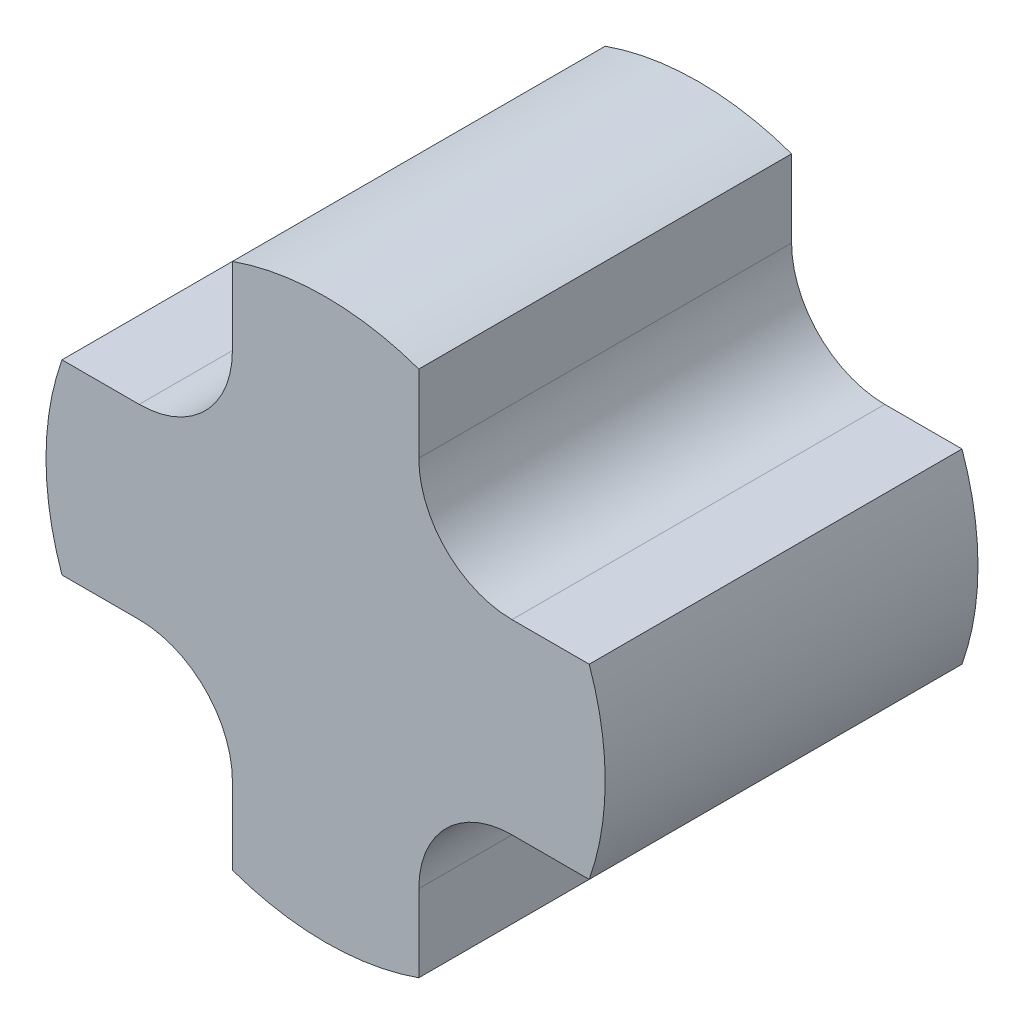
ISO-10303-21;
HEADER;
FILE_DESCRIPTION(('STEP AP214'),'2;1');
FILE_NAME('part.step','',(''),(''),'','','');
FILE_SCHEMA(('AUTOMOTIVE_DESIGN { 1 0 10303 214 1 1 1 1 }'));
ENDSEC;
DATA;
#1=APPLICATION_CONTEXT('core data for automotive mechanical design processes');
#2=APPLICATION_PROTOCOL_DEFINITION('international standard','automotive_design',2000,#1);
#3=PRODUCT_CONTEXT('',#1,'mechanical');
#4=PRODUCT('Part','Part','',(#3));
#5=PRODUCT_RELATED_PRODUCT_CATEGORY('part','',(#4));
#6=PRODUCT_DEFINITION_FORMATION('','',#4);
#7=PRODUCT_DEFINITION_CONTEXT('part definition',#1,'design');
#8=PRODUCT_DEFINITION('design','',#6,#7);
#9=PRODUCT_DEFINITION_SHAPE('','',#8);
#10=(LENGTH_UNIT() NAMED_UNIT(*) SI_UNIT(.MILLI.,.METRE.));
#11=(NAMED_UNIT(*) PLANE_ANGLE_UNIT() SI_UNIT($,.RADIAN.));
#12=(NAMED_UNIT(*) SI_UNIT($,.STERADIAN.) SOLID_ANGLE_UNIT());
#13=UNCERTAINTY_MEASURE_WITH_UNIT(LENGTH_MEASURE(1.E-05),#10,'distance_accuracy_value','');
#14=(GEOMETRIC_REPRESENTATION_CONTEXT(3) GLOBAL_UNCERTAINTY_ASSIGNED_CONTEXT((#13)) GLOBAL_UNIT_ASSIGNED_CONTEXT((#10,
#11,#12)) REPRESENTATION_CONTEXT('',''));
#15=CARTESIAN_POINT('',(0.,0.,0.));
#16=DIRECTION('',(0.,0.,1.));
#17=DIRECTION('',(1.,0.,0.));
#18=AXIS2_PLACEMENT_3D('',#15,#16,#17);
#19=CARTESIAN_POINT('',(-141.42135623731,-50.,200.));
#20=DIRECTION('',(0.,1.,0.));
#21=DIRECTION('',(0.,0.,1.));
#22=AXIS2_PLACEMENT_3D('',#19,#20,#21);
#23=PLANE('',#22);
#24=DIRECTION('',(1.,0.,0.));
#25=VECTOR('',#24,1.);
#26=CARTESIAN_POINT('',(-141.42135623731,-50.,0.));
#27=LINE('',#26,#25);
#28=CARTESIAN_POINT('',(-141.42135623731,-50.,0.));
#29=VERTEX_POINT('',#28);
#30=CARTESIAN_POINT('',(-99.9999999999996,-50.,0.));
#31=VERTEX_POINT('',#30);
#32=EDGE_CURVE('E238',#29,#31,#27,.T.);
#33=ORIENTED_EDGE('',*,*,#32,.T.);
#34=DIRECTION('',(0.,0.,-1.));
#35=VECTOR('',#34,1.);
#36=CARTESIAN_POINT('',(-99.9999999999996,-50.,200.));
#37=LINE('',#36,#35);
#38=CARTESIAN_POINT('',(-99.9999999999996,-50.,200.));
#39=VERTEX_POINT('',#38);
#40=EDGE_CURVE('E62',#31,#39,#37,.F.);
#41=ORIENTED_EDGE('',*,*,#40,.T.);
#42=DIRECTION('',(1.,0.,0.));
#43=VECTOR('',#42,1.);
#44=CARTESIAN_POINT('',(-141.42135623731,-50.,200.));
#45=LINE('',#44,#43);
#46=CARTESIAN_POINT('',(-141.42135623731,-50.,200.));
#47=VERTEX_POINT('',#46);
#48=EDGE_CURVE('E230',#47,#39,#45,.T.);
#49=ORIENTED_EDGE('',*,*,#48,.F.);
#50=DIRECTION('',(0.,0.,-1.));
#51=VECTOR('',#50,1.);
#52=CARTESIAN_POINT('',(-141.42135623731,-50.,200.));
#53=LINE('',#52,#51);
#54=EDGE_CURVE('E243',#47,#29,#53,.T.);
#55=ORIENTED_EDGE('',*,*,#54,.T.);
#56=EDGE_LOOP('',(#33,#41,#49,#55));
#57=FACE_BOUND('',#56,.T.);
#58=ADVANCED_FACE('F41',(#57),#23,.F.);
#59=CARTESIAN_POINT('',(-141.421356237309,50.,200.));
#60=DIRECTION('',(0.,-1.,0.));
#61=DIRECTION('',(0.,0.,-1.));
#62=AXIS2_PLACEMENT_3D('',#59,#60,#61);
#63=PLANE('',#62);
#64=DIRECTION('',(-1.,0.,0.));
#65=VECTOR('',#64,1.);
#66=CARTESIAN_POINT('',(-141.421356237309,50.,200.));
#67=LINE('',#66,#65);
#68=CARTESIAN_POINT('',(-100.,50.,200.));
#69=VERTEX_POINT('',#68);
#70=CARTESIAN_POINT('',(-141.421356237309,50.,200.));
#71=VERTEX_POINT('',#70);
#72=EDGE_CURVE('E233',#69,#71,#67,.T.);
#73=ORIENTED_EDGE('',*,*,#72,.F.);
#74=DIRECTION('',(0.,0.,1.));
#75=VECTOR('',#74,1.);
#76=CARTESIAN_POINT('',(-100.,50.,0.));
#77=LINE('',#76,#75);
#78=CARTESIAN_POINT('',(-100.,50.,0.));
#79=VERTEX_POINT('',#78);
#80=EDGE_CURVE('E257',#69,#79,#77,.F.);
#81=ORIENTED_EDGE('',*,*,#80,.T.);
#82=DIRECTION('',(-1.,0.,0.));
#83=VECTOR('',#82,1.);
#84=CARTESIAN_POINT('',(-141.421356237309,50.,0.));
#85=LINE('',#84,#83);
#86=CARTESIAN_POINT('',(-141.421356237309,50.,0.));
#87=VERTEX_POINT('',#86);
#88=EDGE_CURVE('E231',#79,#87,#85,.T.);
#89=ORIENTED_EDGE('',*,*,#88,.T.);
#90=DIRECTION('',(0.,0.,-1.));
#91=VECTOR('',#90,1.);
#92=CARTESIAN_POINT('',(-141.421356237309,50.,200.));
#93=LINE('',#92,#91);
#94=EDGE_CURVE('E235',#71,#87,#93,.T.);
#95=ORIENTED_EDGE('',*,*,#94,.F.);
#96=EDGE_LOOP('',(#73,#81,#89,#95));
#97=FACE_BOUND('',#96,.T.);
#98=ADVANCED_FACE('F284',(#97),#63,.F.);
#99=CARTESIAN_POINT('',(0.,0.,200.));
#100=DIRECTION('',(0.,0.,-1.));
#101=DIRECTION('',(-1.,0.,0.));
#102=AXIS2_PLACEMENT_3D('',#99,#100,#101);
#103=CYLINDRICAL_SURFACE('',#102,150.);
#104=CARTESIAN_POINT('',(0.,0.,0.));
#105=DIRECTION('',(0.,0.,1.));
#106=DIRECTION('',(1.,0.,0.));
#107=AXIS2_PLACEMENT_3D('',#104,#105,#106);
#108=CIRCLE('',#107,150.);
#109=EDGE_CURVE('E226',#87,#29,#108,.T.);
#110=ORIENTED_EDGE('',*,*,#109,.T.);
#111=ORIENTED_EDGE('',*,*,#54,.F.);
#112=CARTESIAN_POINT('',(0.,0.,200.));
#113=DIRECTION('',(0.,0.,1.));
#114=DIRECTION('',(1.,0.,0.));
#115=AXIS2_PLACEMENT_3D('',#112,#113,#114);
#116=CIRCLE('',#115,150.);
#117=EDGE_CURVE('E227',#71,#47,#116,.T.);
#118=ORIENTED_EDGE('',*,*,#117,.F.);
#119=ORIENTED_EDGE('',*,*,#94,.T.);
#120=EDGE_LOOP('',(#110,#111,#118,#119));
#121=FACE_BOUND('',#120,.T.);
#122=ADVANCED_FACE('F288',(#121),#103,.T.);
#123=CARTESIAN_POINT('',(0.,0.,200.));
#124=DIRECTION('',(0.,0.,1.));
#125=DIRECTION('',(1.,0.,0.));
#126=AXIS2_PLACEMENT_3D('',#123,#124,#125);
#127=PLANE('',#126);
#128=DIRECTION('',(0.,-1.,0.));
#129=VECTOR('',#128,1.);
#130=CARTESIAN_POINT('',(-49.9999999999995,-141.42135623731,200.));
#131=LINE('',#130,#129);
#132=CARTESIAN_POINT('',(-50.0000000000015,141.421356237309,200.));
#133=VERTEX_POINT('',#132);
#134=CARTESIAN_POINT('',(-50.0000000000003,100.,200.));
#135=VERTEX_POINT('',#134);
#136=EDGE_CURVE('E153',#133,#135,#131,.T.);
#137=ORIENTED_EDGE('',*,*,#136,.T.);
#138=CARTESIAN_POINT('',(-100.,100.,200.));
#139=DIRECTION('',(0.,0.,1.));
#140=DIRECTION('',(1.,0.,0.));
#141=AXIS2_PLACEMENT_3D('',#138,#139,#140);
#142=CIRCLE('',#141,50.);
#143=EDGE_CURVE('E271',#135,#69,#142,.F.);
#144=ORIENTED_EDGE('',*,*,#143,.T.);
#145=ORIENTED_EDGE('',*,*,#72,.T.);
#146=ORIENTED_EDGE('',*,*,#117,.T.);
#147=ORIENTED_EDGE('',*,*,#48,.T.);
#148=CARTESIAN_POINT('',(-99.9999999999996,-100.,200.));
#149=DIRECTION('',(0.,0.,1.));
#150=DIRECTION('',(1.,0.,0.));
#151=AXIS2_PLACEMENT_3D('',#148,#149,#150);
#152=CIRCLE('',#151,50.);
#153=CARTESIAN_POINT('',(-49.9999999999997,-99.9999999999998,200.));
#154=VERTEX_POINT('',#153);
#155=EDGE_CURVE('E11',#39,#154,#152,.F.);
#156=ORIENTED_EDGE('',*,*,#155,.T.);
#157=CARTESIAN_POINT('',(-49.9999999999995,-141.42135623731,200.));
#158=VERTEX_POINT('',#157);
#159=EDGE_CURVE('E164',#154,#158,#131,.T.);
#160=ORIENTED_EDGE('',*,*,#159,.T.);
#161=CARTESIAN_POINT('',(0.,0.,200.));
#162=DIRECTION('',(0.,0.,1.));
#163=DIRECTION('',(0.,1.,0.));
#164=AXIS2_PLACEMENT_3D('',#161,#162,#163);
#165=CIRCLE('',#164,150.);
#166=CARTESIAN_POINT('',(50.0000000000005,-141.421356237309,200.));
#167=VERTEX_POINT('',#166);
#168=EDGE_CURVE('E207',#158,#167,#165,.T.);
#169=ORIENTED_EDGE('',*,*,#168,.T.);
#170=DIRECTION('',(0.,1.,0.));
#171=VECTOR('',#170,1.);
#172=CARTESIAN_POINT('',(50.0000000000005,-141.421356237309,200.));
#173=LINE('',#172,#171);
#174=CARTESIAN_POINT('',(50.0000000000003,-100.,200.));
#175=VERTEX_POINT('',#174);
#176=EDGE_CURVE('E210',#167,#175,#173,.T.);
#177=ORIENTED_EDGE('',*,*,#176,.T.);
#178=CARTESIAN_POINT('',(100.,-100.,200.));
#179=DIRECTION('',(0.,0.,1.));
#180=DIRECTION('',(1.,0.,0.));
#181=AXIS2_PLACEMENT_3D('',#178,#179,#180);
#182=CIRCLE('',#181,50.);
#183=CARTESIAN_POINT('',(100.,-50.,200.));
#184=VERTEX_POINT('',#183);
#185=EDGE_CURVE('E269',#175,#184,#182,.F.);
#186=ORIENTED_EDGE('',*,*,#185,.T.);
#187=DIRECTION('',(1.,0.,0.));
#188=VECTOR('',#187,1.);
#189=CARTESIAN_POINT('',(141.421356237309,-50.,200.));
#190=LINE('',#189,#188);
#191=CARTESIAN_POINT('',(141.421356237309,-50.,200.));
#192=VERTEX_POINT('',#191);
#193=EDGE_CURVE('E195',#184,#192,#190,.T.);
#194=ORIENTED_EDGE('',*,*,#193,.T.);
#195=CARTESIAN_POINT('',(0.,0.,200.));
#196=DIRECTION('',(0.,0.,1.));
#197=DIRECTION('',(-1.,0.,0.));
#198=AXIS2_PLACEMENT_3D('',#195,#196,#197);
#199=CIRCLE('',#198,150.);
#200=CARTESIAN_POINT('',(141.42135623731,50.,200.));
#201=VERTEX_POINT('',#200);
#202=EDGE_CURVE('E188',#192,#201,#199,.T.);
#203=ORIENTED_EDGE('',*,*,#202,.T.);
#204=DIRECTION('',(-1.,0.,0.));
#205=VECTOR('',#204,1.);
#206=CARTESIAN_POINT('',(141.42135623731,50.,200.));
#207=LINE('',#206,#205);
#208=CARTESIAN_POINT('',(99.9999999999989,50.,200.));
#209=VERTEX_POINT('',#208);
#210=EDGE_CURVE('E191',#201,#209,#207,.T.);
#211=ORIENTED_EDGE('',*,*,#210,.T.);
#212=CARTESIAN_POINT('',(99.9999999999989,100.,200.));
#213=DIRECTION('',(0.,0.,1.));
#214=DIRECTION('',(1.,0.,0.));
#215=AXIS2_PLACEMENT_3D('',#212,#213,#214);
#216=CIRCLE('',#215,50.);
#217=CARTESIAN_POINT('',(49.999999999999,99.9999999999995,200.));
#218=VERTEX_POINT('',#217);
#219=EDGE_CURVE('E265',#209,#218,#216,.F.);
#220=ORIENTED_EDGE('',*,*,#219,.T.);
#221=DIRECTION('',(0.,1.,0.));
#222=VECTOR('',#221,1.);
#223=CARTESIAN_POINT('',(49.9999999999985,141.42135623731,200.));
#224=LINE('',#223,#222);
#225=CARTESIAN_POINT('',(49.9999999999985,141.42135623731,200.));
#226=VERTEX_POINT('',#225);
#227=EDGE_CURVE('E170',#218,#226,#224,.T.);
#228=ORIENTED_EDGE('',*,*,#227,.T.);
#229=CARTESIAN_POINT('',(0.,0.,200.));
#230=DIRECTION('',(0.,0.,1.));
#231=DIRECTION('',(0.,-1.,0.));
#232=AXIS2_PLACEMENT_3D('',#229,#230,#231);
#233=CIRCLE('',#232,150.);
#234=EDGE_CURVE('E167',#226,#133,#233,.T.);
#235=ORIENTED_EDGE('',*,*,#234,.T.);
#236=EDGE_LOOP('',(#137,#144,#145,#146,#147,#156,#160,#169,#177,#186,#194,#203,#211,#220,#228,#235));
#237=FACE_BOUND('',#236,.T.);
#238=ADVANCED_FACE('F168',(#237),#127,.T.);
#239=CARTESIAN_POINT('',(0.,0.,0.));
#240=DIRECTION('',(0.,0.,1.));
#241=DIRECTION('',(1.,0.,0.));
#242=AXIS2_PLACEMENT_3D('',#239,#240,#241);
#243=PLANE('',#242);
#244=ORIENTED_EDGE('',*,*,#88,.F.);
#245=CARTESIAN_POINT('',(-100.,100.,0.));
#246=DIRECTION('',(0.,0.,1.));
#247=DIRECTION('',(1.,0.,0.));
#248=AXIS2_PLACEMENT_3D('',#245,#246,#247);
#249=CIRCLE('',#248,50.);
#250=CARTESIAN_POINT('',(-50.0000000000003,100.,0.));
#251=VERTEX_POINT('',#250);
#252=EDGE_CURVE('E273',#79,#251,#249,.T.);
#253=ORIENTED_EDGE('',*,*,#252,.T.);
#254=DIRECTION('',(0.,-1.,0.));
#255=VECTOR('',#254,1.);
#256=CARTESIAN_POINT('',(-49.9999999999995,-141.42135623731,0.));
#257=LINE('',#256,#255);
#258=CARTESIAN_POINT('',(-50.0000000000015,141.421356237309,0.));
#259=VERTEX_POINT('',#258);
#260=EDGE_CURVE('E211',#259,#251,#257,.T.);
#261=ORIENTED_EDGE('',*,*,#260,.F.);
#262=CARTESIAN_POINT('',(0.,0.,0.));
#263=DIRECTION('',(0.,0.,1.));
#264=DIRECTION('',(0.,-1.,0.));
#265=AXIS2_PLACEMENT_3D('',#262,#263,#264);
#266=CIRCLE('',#265,150.);
#267=CARTESIAN_POINT('',(49.9999999999985,141.42135623731,0.));
#268=VERTEX_POINT('',#267);
#269=EDGE_CURVE('E178',#268,#259,#266,.T.);
#270=ORIENTED_EDGE('',*,*,#269,.F.);
#271=DIRECTION('',(0.,1.,0.));
#272=VECTOR('',#271,1.);
#273=CARTESIAN_POINT('',(49.9999999999985,141.42135623731,0.));
#274=LINE('',#273,#272);
#275=CARTESIAN_POINT('',(49.999999999999,99.9999999999995,0.));
#276=VERTEX_POINT('',#275);
#277=EDGE_CURVE('E174',#276,#268,#274,.T.);
#278=ORIENTED_EDGE('',*,*,#277,.F.);
#279=CARTESIAN_POINT('',(99.9999999999989,100.,0.));
#280=DIRECTION('',(0.,0.,1.));
#281=DIRECTION('',(1.,0.,0.));
#282=AXIS2_PLACEMENT_3D('',#279,#280,#281);
#283=CIRCLE('',#282,50.);
#284=CARTESIAN_POINT('',(99.9999999999989,50.,0.));
#285=VERTEX_POINT('',#284);
#286=EDGE_CURVE('E263',#276,#285,#283,.T.);
#287=ORIENTED_EDGE('',*,*,#286,.T.);
#288=DIRECTION('',(-1.,0.,0.));
#289=VECTOR('',#288,1.);
#290=CARTESIAN_POINT('',(141.42135623731,50.,0.));
#291=LINE('',#290,#289);
#292=CARTESIAN_POINT('',(141.42135623731,50.,0.));
#293=VERTEX_POINT('',#292);
#294=EDGE_CURVE('E183',#293,#285,#291,.T.);
#295=ORIENTED_EDGE('',*,*,#294,.F.);
#296=CARTESIAN_POINT('',(0.,0.,0.));
#297=DIRECTION('',(0.,0.,1.));
#298=DIRECTION('',(-1.,0.,0.));
#299=AXIS2_PLACEMENT_3D('',#296,#297,#298);
#300=CIRCLE('',#299,150.);
#301=CARTESIAN_POINT('',(141.421356237309,-50.,0.));
#302=VERTEX_POINT('',#301);
#303=EDGE_CURVE('E179',#302,#293,#300,.T.);
#304=ORIENTED_EDGE('',*,*,#303,.F.);
#305=DIRECTION('',(1.,0.,0.));
#306=VECTOR('',#305,1.);
#307=CARTESIAN_POINT('',(141.421356237309,-50.,0.));
#308=LINE('',#307,#306);
#309=CARTESIAN_POINT('',(100.,-50.,0.));
#310=VERTEX_POINT('',#309);
#311=EDGE_CURVE('E192',#310,#302,#308,.T.);
#312=ORIENTED_EDGE('',*,*,#311,.F.);
#313=CARTESIAN_POINT('',(100.,-100.,0.));
#314=DIRECTION('',(0.,0.,1.));
#315=DIRECTION('',(1.,0.,0.));
#316=AXIS2_PLACEMENT_3D('',#313,#314,#315);
#317=CIRCLE('',#316,50.);
#318=CARTESIAN_POINT('',(50.0000000000003,-100.,0.));
#319=VERTEX_POINT('',#318);
#320=EDGE_CURVE('E267',#310,#319,#317,.T.);
#321=ORIENTED_EDGE('',*,*,#320,.T.);
#322=DIRECTION('',(0.,1.,0.));
#323=VECTOR('',#322,1.);
#324=CARTESIAN_POINT('',(50.0000000000005,-141.421356237309,0.));
#325=LINE('',#324,#323);
#326=CARTESIAN_POINT('',(50.0000000000005,-141.421356237309,0.));
#327=VERTEX_POINT('',#326);
#328=EDGE_CURVE('E216',#327,#319,#325,.T.);
#329=ORIENTED_EDGE('',*,*,#328,.F.);
#330=CARTESIAN_POINT('',(0.,0.,0.));
#331=DIRECTION('',(0.,0.,1.));
#332=DIRECTION('',(0.,1.,0.));
#333=AXIS2_PLACEMENT_3D('',#330,#331,#332);
#334=CIRCLE('',#333,150.);
#335=CARTESIAN_POINT('',(-49.9999999999995,-141.42135623731,0.));
#336=VERTEX_POINT('',#335);
#337=EDGE_CURVE('E206',#336,#327,#334,.T.);
#338=ORIENTED_EDGE('',*,*,#337,.F.);
#339=CARTESIAN_POINT('',(-49.9999999999997,-99.9999999999998,0.));
#340=VERTEX_POINT('',#339);
#341=EDGE_CURVE('E219',#340,#336,#257,.T.);
#342=ORIENTED_EDGE('',*,*,#341,.F.);
#343=CARTESIAN_POINT('',(-99.9999999999996,-100.,0.));
#344=DIRECTION('',(0.,0.,1.));
#345=DIRECTION('',(1.,0.,0.));
#346=AXIS2_PLACEMENT_3D('',#343,#344,#345);
#347=CIRCLE('',#346,50.);
#348=EDGE_CURVE('E49',#340,#31,#347,.T.);
#349=ORIENTED_EDGE('',*,*,#348,.T.);
#350=ORIENTED_EDGE('',*,*,#32,.F.);
#351=ORIENTED_EDGE('',*,*,#109,.F.);
#352=EDGE_LOOP('',(#244,#253,#261,#270,#278,#287,#295,#304,#312,#321,#329,#338,#342,#349,#350,#351));
#353=FACE_BOUND('',#352,.T.);
#354=ADVANCED_FACE('F276',(#353),#243,.F.);
#355=CARTESIAN_POINT('',(-49.9999999999995,-141.42135623731,200.));
#356=DIRECTION('',(1.,0.,0.));
#357=DIRECTION('',(0.,0.,-1.));
#358=AXIS2_PLACEMENT_3D('',#355,#356,#357);
#359=PLANE('',#358);
#360=ORIENTED_EDGE('',*,*,#159,.F.);
#361=DIRECTION('',(0.,0.,-1.));
#362=VECTOR('',#361,1.);
#363=CARTESIAN_POINT('',(-49.9999999999997,-99.9999999999998,0.));
#364=LINE('',#363,#362);
#365=EDGE_CURVE('E259',#154,#340,#364,.T.);
#366=ORIENTED_EDGE('',*,*,#365,.T.);
#367=ORIENTED_EDGE('',*,*,#341,.T.);
#368=DIRECTION('',(0.,0.,-1.));
#369=VECTOR('',#368,1.);
#370=CARTESIAN_POINT('',(-49.9999999999995,-141.42135623731,200.));
#371=LINE('',#370,#369);
#372=EDGE_CURVE('E163',#158,#336,#371,.T.);
#373=ORIENTED_EDGE('',*,*,#372,.F.);
#374=EDGE_LOOP('',(#360,#366,#367,#373));
#375=FACE_BOUND('',#374,.T.);
#376=ADVANCED_FACE('F294',(#375),#359,.F.);
#377=ORIENTED_EDGE('',*,*,#260,.T.);
#378=DIRECTION('',(0.,0.,1.));
#379=VECTOR('',#378,1.);
#380=CARTESIAN_POINT('',(-50.0000000000003,100.,200.));
#381=LINE('',#380,#379);
#382=EDGE_CURVE('E161',#251,#135,#381,.T.);
#383=ORIENTED_EDGE('',*,*,#382,.T.);
#384=ORIENTED_EDGE('',*,*,#136,.F.);
#385=DIRECTION('',(0.,0.,-1.));
#386=VECTOR('',#385,1.);
#387=CARTESIAN_POINT('',(-50.0000000000015,141.421356237309,200.));
#388=LINE('',#387,#386);
#389=EDGE_CURVE('E158',#133,#259,#388,.T.);
#390=ORIENTED_EDGE('',*,*,#389,.T.);
#391=EDGE_LOOP('',(#377,#383,#384,#390));
#392=FACE_BOUND('',#391,.T.);
#393=ADVANCED_FACE('F156',(#392),#359,.F.);
#394=CARTESIAN_POINT('',(50.0000000000005,-141.421356237309,200.));
#395=DIRECTION('',(-1.,0.,0.));
#396=DIRECTION('',(0.,0.,1.));
#397=AXIS2_PLACEMENT_3D('',#394,#395,#396);
#398=PLANE('',#397);
#399=ORIENTED_EDGE('',*,*,#328,.T.);
#400=DIRECTION('',(0.,0.,-1.));
#401=VECTOR('',#400,1.);
#402=CARTESIAN_POINT('',(50.0000000000003,-100.,200.));
#403=LINE('',#402,#401);
#404=EDGE_CURVE('E254',#319,#175,#403,.F.);
#405=ORIENTED_EDGE('',*,*,#404,.T.);
#406=ORIENTED_EDGE('',*,*,#176,.F.);
#407=DIRECTION('',(0.,0.,-1.));
#408=VECTOR('',#407,1.);
#409=CARTESIAN_POINT('',(50.0000000000005,-141.421356237309,200.));
#410=LINE('',#409,#408);
#411=EDGE_CURVE('E223',#167,#327,#410,.T.);
#412=ORIENTED_EDGE('',*,*,#411,.T.);
#413=EDGE_LOOP('',(#399,#405,#406,#412));
#414=FACE_BOUND('',#413,.T.);
#415=ADVANCED_FACE('F411',(#414),#398,.F.);
#416=CARTESIAN_POINT('',(0.,0.,200.));
#417=DIRECTION('',(0.,0.,-1.));
#418=DIRECTION('',(0.,-1.,0.));
#419=AXIS2_PLACEMENT_3D('',#416,#417,#418);
#420=CYLINDRICAL_SURFACE('',#419,150.);
#421=ORIENTED_EDGE('',*,*,#337,.T.);
#422=ORIENTED_EDGE('',*,*,#411,.F.);
#423=ORIENTED_EDGE('',*,*,#168,.F.);
#424=ORIENTED_EDGE('',*,*,#372,.T.);
#425=EDGE_LOOP('',(#421,#422,#423,#424));
#426=FACE_BOUND('',#425,.T.);
#427=ADVANCED_FACE('F299',(#426),#420,.T.);
#428=CARTESIAN_POINT('',(141.421356237309,-50.,200.));
#429=DIRECTION('',(0.,1.,0.));
#430=DIRECTION('',(0.,0.,-1.));
#431=AXIS2_PLACEMENT_3D('',#428,#429,#430);
#432=PLANE('',#431);
#433=ORIENTED_EDGE('',*,*,#193,.F.);
#434=DIRECTION('',(0.,0.,-1.));
#435=VECTOR('',#434,1.);
#436=CARTESIAN_POINT('',(100.,-50.,0.));
#437=LINE('',#436,#435);
#438=EDGE_CURVE('E251',#184,#310,#437,.T.);
#439=ORIENTED_EDGE('',*,*,#438,.T.);
#440=ORIENTED_EDGE('',*,*,#311,.T.);
#441=DIRECTION('',(0.,0.,-1.));
#442=VECTOR('',#441,1.);
#443=CARTESIAN_POINT('',(141.421356237309,-50.,200.));
#444=LINE('',#443,#442);
#445=EDGE_CURVE('E196',#192,#302,#444,.T.);
#446=ORIENTED_EDGE('',*,*,#445,.F.);
#447=EDGE_LOOP('',(#433,#439,#440,#446));
#448=FACE_BOUND('',#447,.T.);
#449=ADVANCED_FACE('F310',(#448),#432,.F.);
#450=CARTESIAN_POINT('',(141.42135623731,50.,200.));
#451=DIRECTION('',(0.,-1.,0.));
#452=DIRECTION('',(0.,0.,1.));
#453=AXIS2_PLACEMENT_3D('',#450,#451,#452);
#454=PLANE('',#453);
#455=ORIENTED_EDGE('',*,*,#294,.T.);
#456=DIRECTION('',(0.,0.,-1.));
#457=VECTOR('',#456,1.);
#458=CARTESIAN_POINT('',(99.9999999999989,50.,200.));
#459=LINE('',#458,#457);
#460=EDGE_CURVE('E249',#285,#209,#459,.F.);
#461=ORIENTED_EDGE('',*,*,#460,.T.);
#462=ORIENTED_EDGE('',*,*,#210,.F.);
#463=DIRECTION('',(0.,0.,-1.));
#464=VECTOR('',#463,1.);
#465=CARTESIAN_POINT('',(141.42135623731,50.,200.));
#466=LINE('',#465,#464);
#467=EDGE_CURVE('E203',#201,#293,#466,.T.);
#468=ORIENTED_EDGE('',*,*,#467,.T.);
#469=EDGE_LOOP('',(#455,#461,#462,#468));
#470=FACE_BOUND('',#469,.T.);
#471=ADVANCED_FACE('F328',(#470),#454,.F.);
#472=CARTESIAN_POINT('',(0.,0.,200.));
#473=DIRECTION('',(0.,0.,-1.));
#474=DIRECTION('',(1.,0.,0.));
#475=AXIS2_PLACEMENT_3D('',#472,#473,#474);
#476=CYLINDRICAL_SURFACE('',#475,150.);
#477=ORIENTED_EDGE('',*,*,#303,.T.);
#478=ORIENTED_EDGE('',*,*,#467,.F.);
#479=ORIENTED_EDGE('',*,*,#202,.F.);
#480=ORIENTED_EDGE('',*,*,#445,.T.);
#481=EDGE_LOOP('',(#477,#478,#479,#480));
#482=FACE_BOUND('',#481,.T.);
#483=ADVANCED_FACE('F315',(#482),#476,.T.);
#484=CARTESIAN_POINT('',(49.9999999999985,141.42135623731,200.));
#485=DIRECTION('',(-1.,0.,0.));
#486=DIRECTION('',(0.,0.,-1.));
#487=AXIS2_PLACEMENT_3D('',#484,#485,#486);
#488=PLANE('',#487);
#489=ORIENTED_EDGE('',*,*,#227,.F.);
#490=DIRECTION('',(0.,0.,-1.));
#491=VECTOR('',#490,1.);
#492=CARTESIAN_POINT('',(49.999999999999,99.9999999999995,0.));
#493=LINE('',#492,#491);
#494=EDGE_CURVE('E246',#218,#276,#493,.T.);
#495=ORIENTED_EDGE('',*,*,#494,.T.);
#496=ORIENTED_EDGE('',*,*,#277,.T.);
#497=DIRECTION('',(0.,0.,-1.));
#498=VECTOR('',#497,1.);
#499=CARTESIAN_POINT('',(49.9999999999985,141.42135623731,200.));
#500=LINE('',#499,#498);
#501=EDGE_CURVE('E180',#226,#268,#500,.T.);
#502=ORIENTED_EDGE('',*,*,#501,.F.);
#503=EDGE_LOOP('',(#489,#495,#496,#502));
#504=FACE_BOUND('',#503,.T.);
#505=ADVANCED_FACE('F325',(#504),#488,.F.);
#506=CARTESIAN_POINT('',(0.,0.,200.));
#507=DIRECTION('',(0.,0.,-1.));
#508=DIRECTION('',(0.,1.,0.));
#509=AXIS2_PLACEMENT_3D('',#506,#507,#508);
#510=CYLINDRICAL_SURFACE('',#509,150.);
#511=ORIENTED_EDGE('',*,*,#269,.T.);
#512=ORIENTED_EDGE('',*,*,#389,.F.);
#513=ORIENTED_EDGE('',*,*,#234,.F.);
#514=ORIENTED_EDGE('',*,*,#501,.T.);
#515=EDGE_LOOP('',(#511,#512,#513,#514));
#516=FACE_BOUND('',#515,.T.);
#517=ADVANCED_FACE('F176',(#516),#510,.T.);
#518=CARTESIAN_POINT('',(99.9999999999989,100.,200.));
#519=DIRECTION('',(0.,0.,1.));
#520=DIRECTION('',(1.,0.,0.));
#521=AXIS2_PLACEMENT_3D('',#518,#519,#520);
#522=CYLINDRICAL_SURFACE('',#521,50.);
#523=ORIENTED_EDGE('',*,*,#219,.F.);
#524=ORIENTED_EDGE('',*,*,#460,.F.);
#525=ORIENTED_EDGE('',*,*,#286,.F.);
#526=ORIENTED_EDGE('',*,*,#494,.F.);
#527=EDGE_LOOP('',(#523,#524,#525,#526));
#528=FACE_BOUND('',#527,.T.);
#529=ADVANCED_FACE('F322',(#528),#522,.F.);
#530=CARTESIAN_POINT('',(100.,-100.,200.));
#531=DIRECTION('',(0.,0.,1.));
#532=DIRECTION('',(1.,0.,0.));
#533=AXIS2_PLACEMENT_3D('',#530,#531,#532);
#534=CYLINDRICAL_SURFACE('',#533,50.);
#535=ORIENTED_EDGE('',*,*,#185,.F.);
#536=ORIENTED_EDGE('',*,*,#404,.F.);
#537=ORIENTED_EDGE('',*,*,#320,.F.);
#538=ORIENTED_EDGE('',*,*,#438,.F.);
#539=EDGE_LOOP('',(#535,#536,#537,#538));
#540=FACE_BOUND('',#539,.T.);
#541=ADVANCED_FACE('F307',(#540),#534,.F.);
#542=CARTESIAN_POINT('',(-100.,100.,200.));
#543=DIRECTION('',(0.,0.,-1.));
#544=DIRECTION('',(-1.,0.,0.));
#545=AXIS2_PLACEMENT_3D('',#542,#543,#544);
#546=CYLINDRICAL_SURFACE('',#545,50.);
#547=ORIENTED_EDGE('',*,*,#252,.F.);
#548=ORIENTED_EDGE('',*,*,#80,.F.);
#549=ORIENTED_EDGE('',*,*,#143,.F.);
#550=ORIENTED_EDGE('',*,*,#382,.F.);
#551=EDGE_LOOP('',(#547,#548,#549,#550));
#552=FACE_BOUND('',#551,.T.);
#553=ADVANCED_FACE('F280',(#552),#546,.F.);
#554=CARTESIAN_POINT('',(-99.9999999999996,-100.,200.));
#555=DIRECTION('',(0.,0.,1.));
#556=DIRECTION('',(1.,0.,0.));
#557=AXIS2_PLACEMENT_3D('',#554,#555,#556);
#558=CYLINDRICAL_SURFACE('',#557,50.);
#559=ORIENTED_EDGE('',*,*,#155,.F.);
#560=ORIENTED_EDGE('',*,*,#40,.F.);
#561=ORIENTED_EDGE('',*,*,#348,.F.);
#562=ORIENTED_EDGE('',*,*,#365,.F.);
#563=EDGE_LOOP('',(#559,#560,#561,#562));
#564=FACE_BOUND('',#563,.T.);
#565=ADVANCED_FACE('F43',(#564),#558,.F.);
#566=CLOSED_SHELL('',(#58,#98,#122,#238,#354,#376,#393,#415,#427,#449,#471,#483,#505,#517,#529,
#541,#553,#565));
#567=MANIFOLD_SOLID_BREP('B2',#566);
#568=ADVANCED_BREP_SHAPE_REPRESENTATION('',(#18,#567),#14);
#569=SHAPE_DEFINITION_REPRESENTATION(#9,#568);
ENDSEC;
END-ISO-10303-21;
